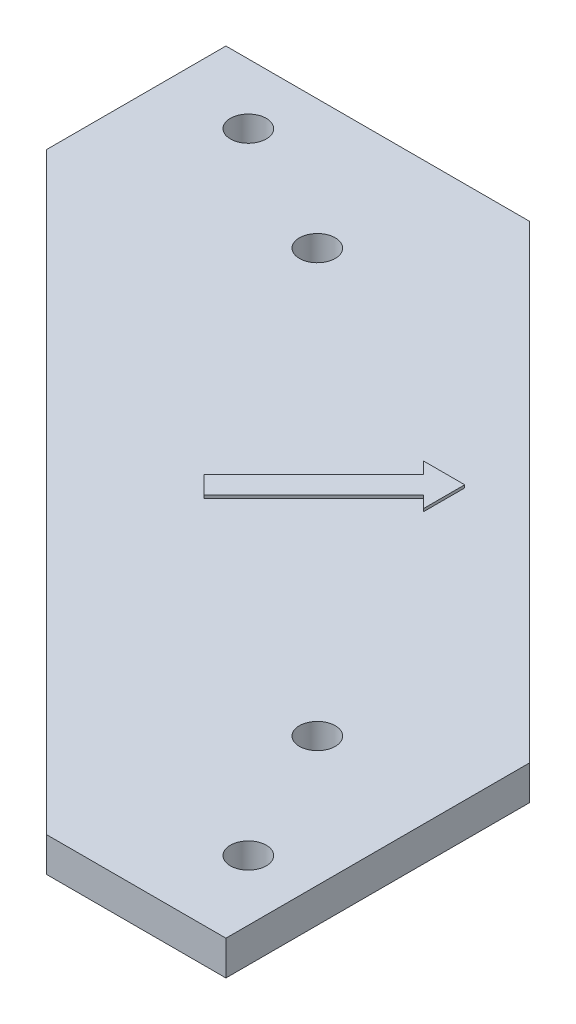
ISO-10303-21;
HEADER;
FILE_DESCRIPTION(('STEP AP214'),'2;1');
FILE_NAME('part.step','',(''),(''),'','','');
FILE_SCHEMA(('AUTOMOTIVE_DESIGN { 1 0 10303 214 1 1 1 1 }'));
ENDSEC;
DATA;
#1=APPLICATION_CONTEXT('core data for automotive mechanical design processes');
#2=APPLICATION_PROTOCOL_DEFINITION('international standard','automotive_design',2000,#1);
#3=PRODUCT_CONTEXT('',#1,'mechanical');
#4=PRODUCT('Part','Part','',(#3));
#5=PRODUCT_RELATED_PRODUCT_CATEGORY('part','',(#4));
#6=PRODUCT_DEFINITION_FORMATION('','',#4);
#7=PRODUCT_DEFINITION_CONTEXT('part definition',#1,'design');
#8=PRODUCT_DEFINITION('design','',#6,#7);
#9=PRODUCT_DEFINITION_SHAPE('','',#8);
#10=(LENGTH_UNIT() NAMED_UNIT(*) SI_UNIT(.MILLI.,.METRE.));
#11=(NAMED_UNIT(*) PLANE_ANGLE_UNIT() SI_UNIT($,.RADIAN.));
#12=(NAMED_UNIT(*) SI_UNIT($,.STERADIAN.) SOLID_ANGLE_UNIT());
#13=UNCERTAINTY_MEASURE_WITH_UNIT(LENGTH_MEASURE(1.E-05),#10,'distance_accuracy_value','');
#14=(GEOMETRIC_REPRESENTATION_CONTEXT(3) GLOBAL_UNCERTAINTY_ASSIGNED_CONTEXT((#13)) GLOBAL_UNIT_ASSIGNED_CONTEXT((#10,
#11,#12)) REPRESENTATION_CONTEXT('',''));
#15=CARTESIAN_POINT('',(0.,0.,0.));
#16=DIRECTION('',(0.,0.,1.));
#17=DIRECTION('',(1.,0.,0.));
#18=AXIS2_PLACEMENT_3D('',#15,#16,#17);
#19=CARTESIAN_POINT('',(0.,3.175,0.));
#20=DIRECTION('',(0.,1.,0.));
#21=DIRECTION('',(0.,0.,1.));
#22=AXIS2_PLACEMENT_3D('',#19,#20,#21);
#23=PLANE('',#22);
#24=CARTESIAN_POINT('',(-5.55605696,3.175,63.5));
#25=DIRECTION('',(0.,1.,0.));
#26=DIRECTION('',(0.,0.,1.));
#27=AXIS2_PLACEMENT_3D('',#24,#25,#26);
#28=CIRCLE('',#27,1.651);
#29=CARTESIAN_POINT('',(-5.55605696,3.175,65.151));
#30=VERTEX_POINT('',#29);
#31=EDGE_CURVE('E156',#30,#30,#28,.T.);
#32=ORIENTED_EDGE('',*,*,#31,.F.);
#33=EDGE_LOOP('',(#32));
#34=FACE_BOUND('',#33,.T.);
#35=CARTESIAN_POINT('',(-11.905836488,3.175,50.8));
#36=DIRECTION('',(0.,1.,0.));
#37=DIRECTION('',(0.,0.,1.));
#38=AXIS2_PLACEMENT_3D('',#35,#36,#37);
#39=CIRCLE('',#38,1.651);
#40=CARTESIAN_POINT('',(-11.905836488,3.175,52.451));
#41=VERTEX_POINT('',#40);
#42=EDGE_CURVE('E201',#41,#41,#39,.T.);
#43=ORIENTED_EDGE('',*,*,#42,.F.);
#44=EDGE_LOOP('',(#43));
#45=FACE_BOUND('',#44,.T.);
#46=CARTESIAN_POINT('',(-50.8,3.175,11.905836488));
#47=DIRECTION('',(0.,1.,0.));
#48=DIRECTION('',(0.,0.,1.));
#49=AXIS2_PLACEMENT_3D('',#46,#47,#48);
#50=CIRCLE('',#49,1.651);
#51=CARTESIAN_POINT('',(-50.8,3.175,13.556836488));
#52=VERTEX_POINT('',#51);
#53=EDGE_CURVE('E388',#52,#52,#50,.T.);
#54=ORIENTED_EDGE('',*,*,#53,.F.);
#55=EDGE_LOOP('',(#54));
#56=FACE_BOUND('',#55,.T.);
#57=CARTESIAN_POINT('',(-63.5,3.175,5.55605696));
#58=DIRECTION('',(0.,1.,0.));
#59=DIRECTION('',(0.,0.,1.));
#60=AXIS2_PLACEMENT_3D('',#57,#58,#59);
#61=CIRCLE('',#60,1.651);
#62=CARTESIAN_POINT('',(-63.5,3.175,7.20705696));
#63=VERTEX_POINT('',#62);
#64=EDGE_CURVE('E391',#63,#63,#61,.T.);
#65=ORIENTED_EDGE('',*,*,#64,.F.);
#66=EDGE_LOOP('',(#65));
#67=FACE_BOUND('',#66,.T.);
#68=DIRECTION('',(-1.,0.,0.));
#69=VECTOR('',#68,1.);
#70=CARTESIAN_POINT('',(0.,3.175,71.12));
#71=LINE('',#70,#69);
#72=CARTESIAN_POINT('',(0.,3.175,71.12));
#73=VERTEX_POINT('',#72);
#74=CARTESIAN_POINT('',(-16.51,3.175,71.12));
#75=VERTEX_POINT('',#74);
#76=EDGE_CURVE('E394',#73,#75,#71,.T.);
#77=ORIENTED_EDGE('',*,*,#76,.F.);
#78=DIRECTION('',(0.,0.,1.));
#79=VECTOR('',#78,1.);
#80=CARTESIAN_POINT('',(0.,3.175,0.));
#81=LINE('',#80,#79);
#82=CARTESIAN_POINT('',(0.,3.175,43.18));
#83=VERTEX_POINT('',#82);
#84=EDGE_CURVE('E396',#83,#73,#81,.T.);
#85=ORIENTED_EDGE('',*,*,#84,.F.);
#86=DIRECTION('',(0.707106781186548,0.,0.707106781186547));
#87=VECTOR('',#86,1.);
#88=CARTESIAN_POINT('',(-21.59,3.175,21.59));
#89=LINE('',#88,#87);
#90=CARTESIAN_POINT('',(-43.18,3.175,0.));
#91=VERTEX_POINT('',#90);
#92=EDGE_CURVE('E122',#91,#83,#89,.T.);
#93=ORIENTED_EDGE('',*,*,#92,.F.);
#94=DIRECTION('',(-1.,0.,0.));
#95=VECTOR('',#94,1.);
#96=CARTESIAN_POINT('',(0.,3.175,0.));
#97=LINE('',#96,#95);
#98=CARTESIAN_POINT('',(-71.12,3.175,0.));
#99=VERTEX_POINT('',#98);
#100=EDGE_CURVE('E115',#91,#99,#97,.T.);
#101=ORIENTED_EDGE('',*,*,#100,.T.);
#102=DIRECTION('',(0.,0.,1.));
#103=VECTOR('',#102,1.);
#104=CARTESIAN_POINT('',(-71.12,3.175,0.));
#105=LINE('',#104,#103);
#106=CARTESIAN_POINT('',(-71.12,3.175,16.51));
#107=VERTEX_POINT('',#106);
#108=EDGE_CURVE('E106',#99,#107,#105,.T.);
#109=ORIENTED_EDGE('',*,*,#108,.T.);
#110=DIRECTION('',(0.707106781186548,0.,0.707106781186547));
#111=VECTOR('',#110,1.);
#112=CARTESIAN_POINT('',(-43.815,3.175,43.815));
#113=LINE('',#112,#111);
#114=EDGE_CURVE('E63',#107,#75,#113,.T.);
#115=ORIENTED_EDGE('',*,*,#114,.T.);
#116=EDGE_LOOP('',(#77,#85,#93,#101,#109,#115));
#117=FACE_BOUND('',#116,.T.);
#118=DIRECTION('',(-1.,0.,0.));
#119=VECTOR('',#118,1.);
#120=CARTESIAN_POINT('',(-24.8994220146787,3.175,24.2390322279773));
#121=LINE('',#120,#119);
#122=CARTESIAN_POINT('',(-24.8994220146787,3.175,24.2390322279773));
#123=VERTEX_POINT('',#122);
#124=CARTESIAN_POINT('',(-28.7094220146787,3.175,24.2390322279773));
#125=VERTEX_POINT('',#124);
#126=EDGE_CURVE('E429',#123,#125,#121,.T.);
#127=ORIENTED_EDGE('',*,*,#126,.F.);
#128=DIRECTION('',(0.,0.,-1.));
#129=VECTOR('',#128,1.);
#130=CARTESIAN_POINT('',(-24.8994220146787,3.175,24.2390322279773));
#131=LINE('',#130,#129);
#132=CARTESIAN_POINT('',(-24.8994220146787,3.175,28.0490322279773));
#133=VERTEX_POINT('',#132);
#134=EDGE_CURVE('E375',#133,#123,#131,.T.);
#135=ORIENTED_EDGE('',*,*,#134,.F.);
#136=DIRECTION('',(0.707106781186548,0.,0.707106781186548));
#137=VECTOR('',#136,1.);
#138=CARTESIAN_POINT('',(-24.8994220146787,3.175,28.0490322279773));
#139=LINE('',#138,#137);
#140=CARTESIAN_POINT('',(-25.977052749207,3.175,26.971401493449));
#141=VERTEX_POINT('',#140);
#142=EDGE_CURVE('E369',#141,#133,#139,.T.);
#143=ORIENTED_EDGE('',*,*,#142,.F.);
#144=DIRECTION('',(0.707106781186547,0.,-0.707106781186548));
#145=VECTOR('',#144,1.);
#146=CARTESIAN_POINT('',(-25.977052749207,3.175,26.971401493449));
#147=LINE('',#146,#145);
#148=CARTESIAN_POINT('',(-36.0723742717272,3.175,37.0667230159693));
#149=VERTEX_POINT('',#148);
#150=EDGE_CURVE('E418',#149,#141,#147,.T.);
#151=ORIENTED_EDGE('',*,*,#150,.F.);
#152=DIRECTION('',(0.707106781186548,0.,0.707106781186548));
#153=VECTOR('',#152,1.);
#154=CARTESIAN_POINT('',(-37.7271128026706,3.175,35.4119844850259));
#155=LINE('',#154,#153);
#156=CARTESIAN_POINT('',(-37.7271128026706,3.175,35.4119844850259));
#157=VERTEX_POINT('',#156);
#158=EDGE_CURVE('E420',#157,#149,#155,.T.);
#159=ORIENTED_EDGE('',*,*,#158,.F.);
#160=DIRECTION('',(-0.707106781186547,0.,0.707106781186548));
#161=VECTOR('',#160,1.);
#162=CARTESIAN_POINT('',(-27.6317912801504,3.175,25.3166629625056));
#163=LINE('',#162,#161);
#164=CARTESIAN_POINT('',(-27.6317912801504,3.175,25.3166629625056));
#165=VERTEX_POINT('',#164);
#166=EDGE_CURVE('E423',#165,#157,#163,.T.);
#167=ORIENTED_EDGE('',*,*,#166,.F.);
#168=DIRECTION('',(0.707106781186549,0.,0.707106781186546));
#169=VECTOR('',#168,1.);
#170=CARTESIAN_POINT('',(-28.7094220146787,3.175,24.2390322279773));
#171=LINE('',#170,#169);
#172=EDGE_CURVE('E426',#125,#165,#171,.T.);
#173=ORIENTED_EDGE('',*,*,#172,.F.);
#174=EDGE_LOOP('',(#127,#135,#143,#151,#159,#167,#173));
#175=FACE_BOUND('',#174,.T.);
#176=ADVANCED_FACE('F39',(#34,#45,#56,#67,#117,#175),#23,.T.);
#177=CARTESIAN_POINT('',(0.,3.175,71.12));
#178=DIRECTION('',(0.,0.,1.));
#179=DIRECTION('',(1.,0.,0.));
#180=AXIS2_PLACEMENT_3D('',#177,#178,#179);
#181=PLANE('',#180);
#182=DIRECTION('',(-1.,0.,0.));
#183=VECTOR('',#182,1.);
#184=CARTESIAN_POINT('',(0.,0.,71.12));
#185=LINE('',#184,#183);
#186=CARTESIAN_POINT('',(0.,0.,71.12));
#187=VERTEX_POINT('',#186);
#188=CARTESIAN_POINT('',(-16.51,0.,71.12));
#189=VERTEX_POINT('',#188);
#190=EDGE_CURVE('E146',#187,#189,#185,.T.);
#191=ORIENTED_EDGE('',*,*,#190,.F.);
#192=DIRECTION('',(0.,-1.,0.));
#193=VECTOR('',#192,1.);
#194=CARTESIAN_POINT('',(0.,3.175,71.12));
#195=LINE('',#194,#193);
#196=EDGE_CURVE('E11',#73,#187,#195,.T.);
#197=ORIENTED_EDGE('',*,*,#196,.F.);
#198=ORIENTED_EDGE('',*,*,#76,.T.);
#199=DIRECTION('',(0.,-1.,0.));
#200=VECTOR('',#199,1.);
#201=CARTESIAN_POINT('',(-16.51,3.175,71.12));
#202=LINE('',#201,#200);
#203=EDGE_CURVE('E89',#75,#189,#202,.T.);
#204=ORIENTED_EDGE('',*,*,#203,.T.);
#205=EDGE_LOOP('',(#191,#197,#198,#204));
#206=FACE_BOUND('',#205,.T.);
#207=ADVANCED_FACE('F171',(#206),#181,.T.);
#208=CARTESIAN_POINT('',(0.,3.175,0.));
#209=DIRECTION('',(1.,0.,0.));
#210=DIRECTION('',(0.,0.,-1.));
#211=AXIS2_PLACEMENT_3D('',#208,#209,#210);
#212=PLANE('',#211);
#213=DIRECTION('',(0.,0.,1.));
#214=VECTOR('',#213,1.);
#215=CARTESIAN_POINT('',(0.,0.,0.));
#216=LINE('',#215,#214);
#217=CARTESIAN_POINT('',(0.,0.,43.18));
#218=VERTEX_POINT('',#217);
#219=EDGE_CURVE('E142',#218,#187,#216,.T.);
#220=ORIENTED_EDGE('',*,*,#219,.F.);
#221=DIRECTION('',(0.,-1.,0.));
#222=VECTOR('',#221,1.);
#223=CARTESIAN_POINT('',(0.,3.175,43.18));
#224=LINE('',#223,#222);
#225=EDGE_CURVE('E47',#83,#218,#224,.T.);
#226=ORIENTED_EDGE('',*,*,#225,.F.);
#227=ORIENTED_EDGE('',*,*,#84,.T.);
#228=ORIENTED_EDGE('',*,*,#196,.T.);
#229=EDGE_LOOP('',(#220,#226,#227,#228));
#230=FACE_BOUND('',#229,.T.);
#231=ADVANCED_FACE('F143',(#230),#212,.T.);
#232=CARTESIAN_POINT('',(-21.59,3.175,21.59));
#233=DIRECTION('',(0.707106781186547,0.,-0.707106781186548));
#234=DIRECTION('',(-0.707106781186548,0.,-0.707106781186547));
#235=AXIS2_PLACEMENT_3D('',#232,#233,#234);
#236=PLANE('',#235);
#237=DIRECTION('',(0.707106781186548,0.,0.707106781186547));
#238=VECTOR('',#237,1.);
#239=CARTESIAN_POINT('',(-21.59,0.,21.59));
#240=LINE('',#239,#238);
#241=CARTESIAN_POINT('',(-43.18,0.,0.));
#242=VERTEX_POINT('',#241);
#243=EDGE_CURVE('E138',#242,#218,#240,.T.);
#244=ORIENTED_EDGE('',*,*,#243,.F.);
#245=DIRECTION('',(0.,-1.,0.));
#246=VECTOR('',#245,1.);
#247=CARTESIAN_POINT('',(-43.18,3.175,0.));
#248=LINE('',#247,#246);
#249=EDGE_CURVE('E128',#91,#242,#248,.T.);
#250=ORIENTED_EDGE('',*,*,#249,.F.);
#251=ORIENTED_EDGE('',*,*,#92,.T.);
#252=ORIENTED_EDGE('',*,*,#225,.T.);
#253=EDGE_LOOP('',(#244,#250,#251,#252));
#254=FACE_BOUND('',#253,.T.);
#255=ADVANCED_FACE('F136',(#254),#236,.T.);
#256=CARTESIAN_POINT('',(0.,3.175,0.));
#257=DIRECTION('',(0.,0.,1.));
#258=DIRECTION('',(1.,0.,0.));
#259=AXIS2_PLACEMENT_3D('',#256,#257,#258);
#260=PLANE('',#259);
#261=DIRECTION('',(-1.,0.,0.));
#262=VECTOR('',#261,1.);
#263=CARTESIAN_POINT('',(0.,0.,0.));
#264=LINE('',#263,#262);
#265=CARTESIAN_POINT('',(-71.12,0.,0.));
#266=VERTEX_POINT('',#265);
#267=EDGE_CURVE('E127',#242,#266,#264,.T.);
#268=ORIENTED_EDGE('',*,*,#267,.T.);
#269=DIRECTION('',(0.,-1.,0.));
#270=VECTOR('',#269,1.);
#271=CARTESIAN_POINT('',(-71.12,3.175,0.));
#272=LINE('',#271,#270);
#273=EDGE_CURVE('E111',#99,#266,#272,.T.);
#274=ORIENTED_EDGE('',*,*,#273,.F.);
#275=ORIENTED_EDGE('',*,*,#100,.F.);
#276=ORIENTED_EDGE('',*,*,#249,.T.);
#277=EDGE_LOOP('',(#268,#274,#275,#276));
#278=FACE_BOUND('',#277,.T.);
#279=ADVANCED_FACE('F125',(#278),#260,.F.);
#280=CARTESIAN_POINT('',(-71.12,3.175,0.));
#281=DIRECTION('',(1.,0.,0.));
#282=DIRECTION('',(0.,0.,-1.));
#283=AXIS2_PLACEMENT_3D('',#280,#281,#282);
#284=PLANE('',#283);
#285=DIRECTION('',(0.,0.,1.));
#286=VECTOR('',#285,1.);
#287=CARTESIAN_POINT('',(-71.12,0.,0.));
#288=LINE('',#287,#286);
#289=CARTESIAN_POINT('',(-71.12,0.,16.51));
#290=VERTEX_POINT('',#289);
#291=EDGE_CURVE('E150',#266,#290,#288,.T.);
#292=ORIENTED_EDGE('',*,*,#291,.T.);
#293=DIRECTION('',(0.,-1.,0.));
#294=VECTOR('',#293,1.);
#295=CARTESIAN_POINT('',(-71.12,3.175,16.51));
#296=LINE('',#295,#294);
#297=EDGE_CURVE('E114',#107,#290,#296,.T.);
#298=ORIENTED_EDGE('',*,*,#297,.F.);
#299=ORIENTED_EDGE('',*,*,#108,.F.);
#300=ORIENTED_EDGE('',*,*,#273,.T.);
#301=EDGE_LOOP('',(#292,#298,#299,#300));
#302=FACE_BOUND('',#301,.T.);
#303=ADVANCED_FACE('F109',(#302),#284,.F.);
#304=CARTESIAN_POINT('',(-63.5,3.175,5.55605696));
#305=DIRECTION('',(0.,-1.,0.));
#306=DIRECTION('',(0.,0.,-1.));
#307=AXIS2_PLACEMENT_3D('',#304,#305,#306);
#308=CYLINDRICAL_SURFACE('',#307,1.651);
#309=ORIENTED_EDGE('',*,*,#64,.T.);
#310=EDGE_LOOP('',(#309));
#311=FACE_BOUND('',#310,.T.);
#312=CARTESIAN_POINT('',(-63.5,0.,5.55605696));
#313=DIRECTION('',(0.,1.,0.));
#314=DIRECTION('',(0.,0.,1.));
#315=AXIS2_PLACEMENT_3D('',#312,#313,#314);
#316=CIRCLE('',#315,1.651);
#317=CARTESIAN_POINT('',(-63.5,0.,7.20705696));
#318=VERTEX_POINT('',#317);
#319=EDGE_CURVE('E169',#318,#318,#316,.T.);
#320=ORIENTED_EDGE('',*,*,#319,.F.);
#321=EDGE_LOOP('',(#320));
#322=FACE_BOUND('',#321,.T.);
#323=ADVANCED_FACE('F183',(#311,#322),#308,.F.);
#324=CARTESIAN_POINT('',(-50.8,3.175,11.905836488));
#325=DIRECTION('',(0.,-1.,0.));
#326=DIRECTION('',(0.,0.,-1.));
#327=AXIS2_PLACEMENT_3D('',#324,#325,#326);
#328=CYLINDRICAL_SURFACE('',#327,1.651);
#329=ORIENTED_EDGE('',*,*,#53,.T.);
#330=EDGE_LOOP('',(#329));
#331=FACE_BOUND('',#330,.T.);
#332=CARTESIAN_POINT('',(-50.8,0.,11.905836488));
#333=DIRECTION('',(0.,1.,0.));
#334=DIRECTION('',(0.,0.,1.));
#335=AXIS2_PLACEMENT_3D('',#332,#333,#334);
#336=CIRCLE('',#335,1.651);
#337=CARTESIAN_POINT('',(-50.8,0.,13.556836488));
#338=VERTEX_POINT('',#337);
#339=EDGE_CURVE('E166',#338,#338,#336,.T.);
#340=ORIENTED_EDGE('',*,*,#339,.F.);
#341=EDGE_LOOP('',(#340));
#342=FACE_BOUND('',#341,.T.);
#343=ADVANCED_FACE('F186',(#331,#342),#328,.F.);
#344=CARTESIAN_POINT('',(-11.905836488,3.175,50.8));
#345=DIRECTION('',(0.,-1.,0.));
#346=DIRECTION('',(0.,0.,-1.));
#347=AXIS2_PLACEMENT_3D('',#344,#345,#346);
#348=CYLINDRICAL_SURFACE('',#347,1.651);
#349=ORIENTED_EDGE('',*,*,#42,.T.);
#350=EDGE_LOOP('',(#349));
#351=FACE_BOUND('',#350,.T.);
#352=CARTESIAN_POINT('',(-11.905836488,0.,50.8));
#353=DIRECTION('',(0.,1.,0.));
#354=DIRECTION('',(0.,0.,1.));
#355=AXIS2_PLACEMENT_3D('',#352,#353,#354);
#356=CIRCLE('',#355,1.651);
#357=CARTESIAN_POINT('',(-11.905836488,0.,52.451));
#358=VERTEX_POINT('',#357);
#359=EDGE_CURVE('E162',#358,#358,#356,.T.);
#360=ORIENTED_EDGE('',*,*,#359,.F.);
#361=EDGE_LOOP('',(#360));
#362=FACE_BOUND('',#361,.T.);
#363=ADVANCED_FACE('F189',(#351,#362),#348,.F.);
#364=CARTESIAN_POINT('',(-5.55605696,3.175,63.5));
#365=DIRECTION('',(0.,-1.,0.));
#366=DIRECTION('',(0.,0.,-1.));
#367=AXIS2_PLACEMENT_3D('',#364,#365,#366);
#368=CYLINDRICAL_SURFACE('',#367,1.651);
#369=ORIENTED_EDGE('',*,*,#31,.T.);
#370=EDGE_LOOP('',(#369));
#371=FACE_BOUND('',#370,.T.);
#372=CARTESIAN_POINT('',(-5.55605696,0.,63.5));
#373=DIRECTION('',(0.,1.,0.));
#374=DIRECTION('',(0.,0.,1.));
#375=AXIS2_PLACEMENT_3D('',#372,#373,#374);
#376=CIRCLE('',#375,1.651);
#377=CARTESIAN_POINT('',(-5.55605696,0.,65.151));
#378=VERTEX_POINT('',#377);
#379=EDGE_CURVE('E159',#378,#378,#376,.T.);
#380=ORIENTED_EDGE('',*,*,#379,.F.);
#381=EDGE_LOOP('',(#380));
#382=FACE_BOUND('',#381,.T.);
#383=ADVANCED_FACE('F41',(#371,#382),#368,.F.);
#384=CARTESIAN_POINT('',(-43.815,3.175,43.815));
#385=DIRECTION('',(0.707106781186547,0.,-0.707106781186548));
#386=DIRECTION('',(-0.707106781186548,0.,-0.707106781186547));
#387=AXIS2_PLACEMENT_3D('',#384,#385,#386);
#388=PLANE('',#387);
#389=DIRECTION('',(0.707106781186548,0.,0.707106781186547));
#390=VECTOR('',#389,1.);
#391=CARTESIAN_POINT('',(-43.815,0.,43.815));
#392=LINE('',#391,#390);
#393=EDGE_CURVE('E155',#290,#189,#392,.T.);
#394=ORIENTED_EDGE('',*,*,#393,.T.);
#395=ORIENTED_EDGE('',*,*,#203,.F.);
#396=ORIENTED_EDGE('',*,*,#114,.F.);
#397=ORIENTED_EDGE('',*,*,#297,.T.);
#398=EDGE_LOOP('',(#394,#395,#396,#397));
#399=FACE_BOUND('',#398,.T.);
#400=ADVANCED_FACE('F196',(#399),#388,.F.);
#401=CARTESIAN_POINT('',(0.,0.,0.));
#402=DIRECTION('',(0.,1.,0.));
#403=DIRECTION('',(0.,0.,1.));
#404=AXIS2_PLACEMENT_3D('',#401,#402,#403);
#405=PLANE('',#404);
#406=ORIENTED_EDGE('',*,*,#379,.T.);
#407=EDGE_LOOP('',(#406));
#408=FACE_BOUND('',#407,.T.);
#409=ORIENTED_EDGE('',*,*,#359,.T.);
#410=EDGE_LOOP('',(#409));
#411=FACE_BOUND('',#410,.T.);
#412=ORIENTED_EDGE('',*,*,#339,.T.);
#413=EDGE_LOOP('',(#412));
#414=FACE_BOUND('',#413,.T.);
#415=ORIENTED_EDGE('',*,*,#319,.T.);
#416=EDGE_LOOP('',(#415));
#417=FACE_BOUND('',#416,.T.);
#418=ORIENTED_EDGE('',*,*,#190,.T.);
#419=ORIENTED_EDGE('',*,*,#393,.F.);
#420=ORIENTED_EDGE('',*,*,#291,.F.);
#421=ORIENTED_EDGE('',*,*,#267,.F.);
#422=ORIENTED_EDGE('',*,*,#243,.T.);
#423=ORIENTED_EDGE('',*,*,#219,.T.);
#424=EDGE_LOOP('',(#418,#419,#420,#421,#422,#423));
#425=FACE_BOUND('',#424,.T.);
#426=ADVANCED_FACE('F148',(#408,#411,#414,#417,#425),#405,.F.);
#427=CARTESIAN_POINT('',(-24.8994220146787,3.429,24.2390322279773));
#428=DIRECTION('',(-1.,0.,0.));
#429=DIRECTION('',(0.,0.,1.));
#430=AXIS2_PLACEMENT_3D('',#427,#428,#429);
#431=PLANE('',#430);
#432=ORIENTED_EDGE('',*,*,#134,.T.);
#433=DIRECTION('',(0.,-1.,0.));
#434=VECTOR('',#433,1.);
#435=CARTESIAN_POINT('',(-24.8994220146787,3.429,24.2390322279773));
#436=LINE('',#435,#434);
#437=CARTESIAN_POINT('',(-24.8994220146787,3.429,24.2390322279773));
#438=VERTEX_POINT('',#437);
#439=EDGE_CURVE('E163',#438,#123,#436,.T.);
#440=ORIENTED_EDGE('',*,*,#439,.F.);
#441=DIRECTION('',(0.,0.,-1.));
#442=VECTOR('',#441,1.);
#443=CARTESIAN_POINT('',(-24.8994220146787,3.429,24.2390322279773));
#444=LINE('',#443,#442);
#445=CARTESIAN_POINT('',(-24.8994220146787,3.429,28.0490322279773));
#446=VERTEX_POINT('',#445);
#447=EDGE_CURVE('E357',#446,#438,#444,.T.);
#448=ORIENTED_EDGE('',*,*,#447,.F.);
#449=DIRECTION('',(0.,-1.,0.));
#450=VECTOR('',#449,1.);
#451=CARTESIAN_POINT('',(-24.8994220146787,3.429,28.0490322279773));
#452=LINE('',#451,#450);
#453=EDGE_CURVE('E415',#446,#133,#452,.T.);
#454=ORIENTED_EDGE('',*,*,#453,.T.);
#455=EDGE_LOOP('',(#432,#440,#448,#454));
#456=FACE_BOUND('',#455,.T.);
#457=ADVANCED_FACE('F206',(#456),#431,.F.);
#458=CARTESIAN_POINT('',(-24.8994220146787,3.429,24.2390322279773));
#459=DIRECTION('',(0.,0.,1.));
#460=DIRECTION('',(1.,0.,0.));
#461=AXIS2_PLACEMENT_3D('',#458,#459,#460);
#462=PLANE('',#461);
#463=ORIENTED_EDGE('',*,*,#126,.T.);
#464=DIRECTION('',(0.,-1.,0.));
#465=VECTOR('',#464,1.);
#466=CARTESIAN_POINT('',(-28.7094220146787,3.429,24.2390322279773));
#467=LINE('',#466,#465);
#468=CARTESIAN_POINT('',(-28.7094220146787,3.429,24.2390322279773));
#469=VERTEX_POINT('',#468);
#470=EDGE_CURVE('E378',#469,#125,#467,.T.);
#471=ORIENTED_EDGE('',*,*,#470,.F.);
#472=DIRECTION('',(-1.,0.,0.));
#473=VECTOR('',#472,1.);
#474=CARTESIAN_POINT('',(-24.8994220146787,3.429,24.2390322279773));
#475=LINE('',#474,#473);
#476=EDGE_CURVE('E362',#438,#469,#475,.T.);
#477=ORIENTED_EDGE('',*,*,#476,.F.);
#478=ORIENTED_EDGE('',*,*,#439,.T.);
#479=EDGE_LOOP('',(#463,#471,#477,#478));
#480=FACE_BOUND('',#479,.T.);
#481=ADVANCED_FACE('F218',(#480),#462,.F.);
#482=CARTESIAN_POINT('',(-28.7094220146787,3.429,24.2390322279773));
#483=DIRECTION('',(0.707106781186546,0.,-0.707106781186549));
#484=DIRECTION('',(-0.707106781186549,0.,-0.707106781186546));
#485=AXIS2_PLACEMENT_3D('',#482,#483,#484);
#486=PLANE('',#485);
#487=ORIENTED_EDGE('',*,*,#172,.T.);
#488=DIRECTION('',(0.,-1.,0.));
#489=VECTOR('',#488,1.);
#490=CARTESIAN_POINT('',(-27.6317912801504,3.429,25.3166629625056));
#491=LINE('',#490,#489);
#492=CARTESIAN_POINT('',(-27.6317912801504,3.429,25.3166629625056));
#493=VERTEX_POINT('',#492);
#494=EDGE_CURVE('E381',#493,#165,#491,.T.);
#495=ORIENTED_EDGE('',*,*,#494,.F.);
#496=DIRECTION('',(0.707106781186549,0.,0.707106781186546));
#497=VECTOR('',#496,1.);
#498=CARTESIAN_POINT('',(-28.7094220146787,3.429,24.2390322279773));
#499=LINE('',#498,#497);
#500=EDGE_CURVE('E441',#469,#493,#499,.T.);
#501=ORIENTED_EDGE('',*,*,#500,.F.);
#502=ORIENTED_EDGE('',*,*,#470,.T.);
#503=EDGE_LOOP('',(#487,#495,#501,#502));
#504=FACE_BOUND('',#503,.T.);
#505=ADVANCED_FACE('F289',(#504),#486,.F.);
#506=CARTESIAN_POINT('',(-27.6317912801504,3.429,25.3166629625056));
#507=DIRECTION('',(0.707106781186548,0.,0.707106781186547));
#508=DIRECTION('',(0.707106781186547,0.,-0.707106781186548));
#509=AXIS2_PLACEMENT_3D('',#506,#507,#508);
#510=PLANE('',#509);
#511=ORIENTED_EDGE('',*,*,#166,.T.);
#512=DIRECTION('',(0.,-1.,0.));
#513=VECTOR('',#512,1.);
#514=CARTESIAN_POINT('',(-37.7271128026706,3.429,35.4119844850259));
#515=LINE('',#514,#513);
#516=CARTESIAN_POINT('',(-37.7271128026706,3.429,35.4119844850259));
#517=VERTEX_POINT('',#516);
#518=EDGE_CURVE('E408',#517,#157,#515,.T.);
#519=ORIENTED_EDGE('',*,*,#518,.F.);
#520=DIRECTION('',(-0.707106781186547,0.,0.707106781186548));
#521=VECTOR('',#520,1.);
#522=CARTESIAN_POINT('',(-27.6317912801504,3.429,25.3166629625056));
#523=LINE('',#522,#521);
#524=EDGE_CURVE('E438',#493,#517,#523,.T.);
#525=ORIENTED_EDGE('',*,*,#524,.F.);
#526=ORIENTED_EDGE('',*,*,#494,.T.);
#527=EDGE_LOOP('',(#511,#519,#525,#526));
#528=FACE_BOUND('',#527,.T.);
#529=ADVANCED_FACE('F299',(#528),#510,.F.);
#530=CARTESIAN_POINT('',(-37.7271128026706,3.429,35.4119844850259));
#531=DIRECTION('',(0.707106781186548,0.,-0.707106781186548));
#532=DIRECTION('',(-0.707106781186548,0.,-0.707106781186548));
#533=AXIS2_PLACEMENT_3D('',#530,#531,#532);
#534=PLANE('',#533);
#535=ORIENTED_EDGE('',*,*,#158,.T.);
#536=DIRECTION('',(0.,-1.,0.));
#537=VECTOR('',#536,1.);
#538=CARTESIAN_POINT('',(-36.0723742717272,3.429,37.0667230159693));
#539=LINE('',#538,#537);
#540=CARTESIAN_POINT('',(-36.0723742717272,3.429,37.0667230159693));
#541=VERTEX_POINT('',#540);
#542=EDGE_CURVE('E411',#541,#149,#539,.T.);
#543=ORIENTED_EDGE('',*,*,#542,.F.);
#544=DIRECTION('',(0.707106781186548,0.,0.707106781186548));
#545=VECTOR('',#544,1.);
#546=CARTESIAN_POINT('',(-37.7271128026706,3.429,35.4119844850259));
#547=LINE('',#546,#545);
#548=EDGE_CURVE('E435',#517,#541,#547,.T.);
#549=ORIENTED_EDGE('',*,*,#548,.F.);
#550=ORIENTED_EDGE('',*,*,#518,.T.);
#551=EDGE_LOOP('',(#535,#543,#549,#550));
#552=FACE_BOUND('',#551,.T.);
#553=ADVANCED_FACE('F309',(#552),#534,.F.);
#554=CARTESIAN_POINT('',(-25.977052749207,3.429,26.971401493449));
#555=DIRECTION('',(-0.707106781186548,0.,-0.707106781186547));
#556=DIRECTION('',(-0.707106781186547,0.,0.707106781186548));
#557=AXIS2_PLACEMENT_3D('',#554,#555,#556);
#558=PLANE('',#557);
#559=ORIENTED_EDGE('',*,*,#150,.T.);
#560=DIRECTION('',(0.,-1.,0.));
#561=VECTOR('',#560,1.);
#562=CARTESIAN_POINT('',(-25.977052749207,3.429,26.971401493449));
#563=LINE('',#562,#561);
#564=CARTESIAN_POINT('',(-25.977052749207,3.429,26.971401493449));
#565=VERTEX_POINT('',#564);
#566=EDGE_CURVE('E54',#565,#141,#563,.T.);
#567=ORIENTED_EDGE('',*,*,#566,.F.);
#568=DIRECTION('',(0.707106781186547,0.,-0.707106781186548));
#569=VECTOR('',#568,1.);
#570=CARTESIAN_POINT('',(-25.977052749207,3.429,26.971401493449));
#571=LINE('',#570,#569);
#572=EDGE_CURVE('E433',#541,#565,#571,.T.);
#573=ORIENTED_EDGE('',*,*,#572,.F.);
#574=ORIENTED_EDGE('',*,*,#542,.T.);
#575=EDGE_LOOP('',(#559,#567,#573,#574));
#576=FACE_BOUND('',#575,.T.);
#577=ADVANCED_FACE('F319',(#576),#558,.F.);
#578=CARTESIAN_POINT('',(-24.8994220146787,3.429,28.0490322279773));
#579=DIRECTION('',(0.707106781186548,0.,-0.707106781186548));
#580=DIRECTION('',(-0.707106781186548,0.,-0.707106781186548));
#581=AXIS2_PLACEMENT_3D('',#578,#579,#580);
#582=PLANE('',#581);
#583=ORIENTED_EDGE('',*,*,#142,.T.);
#584=ORIENTED_EDGE('',*,*,#453,.F.);
#585=DIRECTION('',(0.707106781186548,0.,0.707106781186548));
#586=VECTOR('',#585,1.);
#587=CARTESIAN_POINT('',(-24.8994220146787,3.429,28.0490322279773));
#588=LINE('',#587,#586);
#589=EDGE_CURVE('E365',#565,#446,#588,.T.);
#590=ORIENTED_EDGE('',*,*,#589,.F.);
#591=ORIENTED_EDGE('',*,*,#566,.T.);
#592=EDGE_LOOP('',(#583,#584,#590,#591));
#593=FACE_BOUND('',#592,.T.);
#594=ADVANCED_FACE('F329',(#593),#582,.F.);
#595=CARTESIAN_POINT('',(0.,3.429,0.));
#596=DIRECTION('',(0.,-1.,0.));
#597=DIRECTION('',(0.,0.,-1.));
#598=AXIS2_PLACEMENT_3D('',#595,#596,#597);
#599=PLANE('',#598);
#600=ORIENTED_EDGE('',*,*,#447,.T.);
#601=ORIENTED_EDGE('',*,*,#476,.T.);
#602=ORIENTED_EDGE('',*,*,#500,.T.);
#603=ORIENTED_EDGE('',*,*,#524,.T.);
#604=ORIENTED_EDGE('',*,*,#548,.T.);
#605=ORIENTED_EDGE('',*,*,#572,.T.);
#606=ORIENTED_EDGE('',*,*,#589,.T.);
#607=EDGE_LOOP('',(#600,#601,#602,#603,#604,#605,#606));
#608=FACE_BOUND('',#607,.T.);
#609=ADVANCED_FACE('F339',(#608),#599,.F.);
#610=CLOSED_SHELL('',(#176,#207,#231,#255,#279,#303,#323,#343,#363,#383,#400,#426,#457,#481,
#505,#529,#553,#577,#594,#609));
#611=MANIFOLD_SOLID_BREP('B2',#610);
#612=ADVANCED_BREP_SHAPE_REPRESENTATION('',(#18,#611),#14);
#613=SHAPE_DEFINITION_REPRESENTATION(#9,#612);
ENDSEC;
END-ISO-10303-21;
